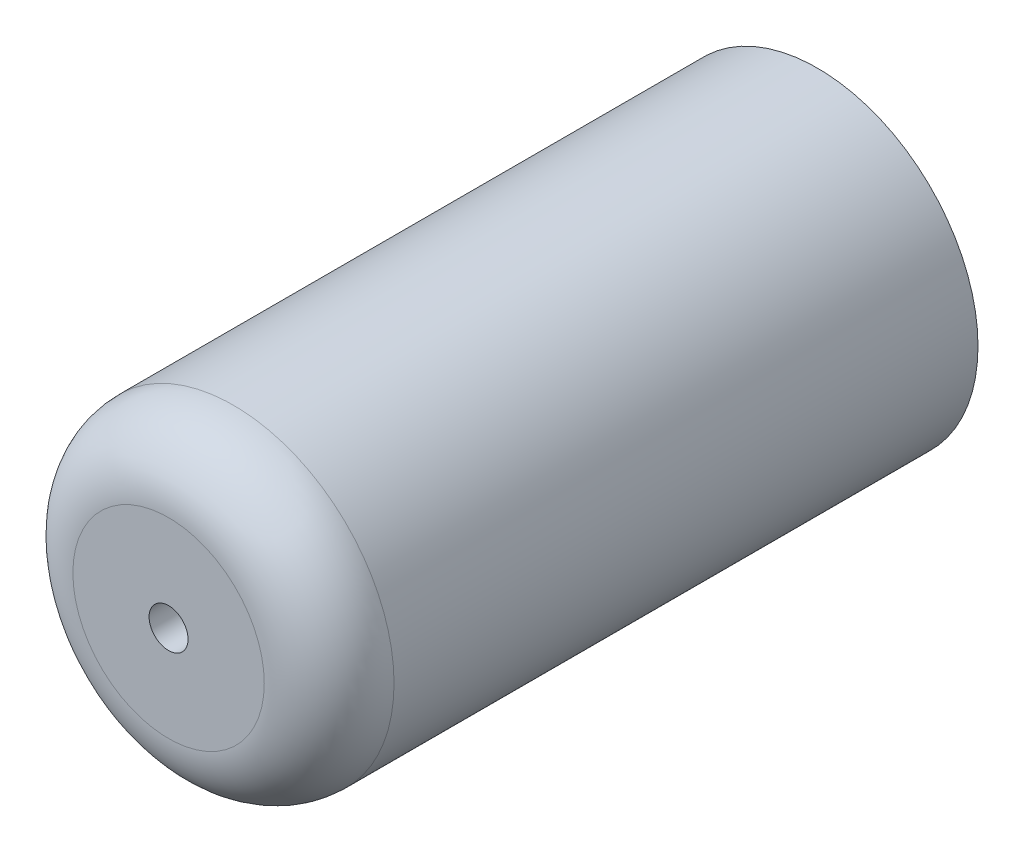
ISO-10303-21;
HEADER;
FILE_DESCRIPTION(('STEP AP214'),'2;1');
FILE_NAME('part.step','',(''),(''),'','','');
FILE_SCHEMA(('AUTOMOTIVE_DESIGN { 1 0 10303 214 1 1 1 1 }'));
ENDSEC;
DATA;
#1=APPLICATION_CONTEXT('core data for automotive mechanical design processes');
#2=APPLICATION_PROTOCOL_DEFINITION('international standard','automotive_design',2000,#1);
#3=PRODUCT_CONTEXT('',#1,'mechanical');
#4=PRODUCT('Part','Part','',(#3));
#5=PRODUCT_RELATED_PRODUCT_CATEGORY('part','',(#4));
#6=PRODUCT_DEFINITION_FORMATION('','',#4);
#7=PRODUCT_DEFINITION_CONTEXT('part definition',#1,'design');
#8=PRODUCT_DEFINITION('design','',#6,#7);
#9=PRODUCT_DEFINITION_SHAPE('','',#8);
#10=(LENGTH_UNIT() NAMED_UNIT(*) SI_UNIT(.MILLI.,.METRE.));
#11=(NAMED_UNIT(*) PLANE_ANGLE_UNIT() SI_UNIT($,.RADIAN.));
#12=(NAMED_UNIT(*) SI_UNIT($,.STERADIAN.) SOLID_ANGLE_UNIT());
#13=UNCERTAINTY_MEASURE_WITH_UNIT(LENGTH_MEASURE(1.E-05),#10,'distance_accuracy_value','');
#14=(GEOMETRIC_REPRESENTATION_CONTEXT(3) GLOBAL_UNCERTAINTY_ASSIGNED_CONTEXT((#13)) GLOBAL_UNIT_ASSIGNED_CONTEXT((#10,
#11,#12)) REPRESENTATION_CONTEXT('',''));
#15=CARTESIAN_POINT('',(0.,0.,0.));
#16=DIRECTION('',(0.,0.,1.));
#17=DIRECTION('',(1.,0.,0.));
#18=AXIS2_PLACEMENT_3D('',#15,#16,#17);
#19=CARTESIAN_POINT('',(0.,0.,50.));
#20=DIRECTION('',(0.,0.,-1.));
#21=DIRECTION('',(-1.,0.,0.));
#22=AXIS2_PLACEMENT_3D('',#19,#20,#21);
#23=CYLINDRICAL_SURFACE('',#22,12.375);
#24=CARTESIAN_POINT('',(0.,0.,45.));
#25=DIRECTION('',(0.,0.,1.));
#26=DIRECTION('',(1.,0.,0.));
#27=AXIS2_PLACEMENT_3D('',#24,#25,#26);
#28=CIRCLE('',#27,12.375);
#29=CARTESIAN_POINT('',(12.375,0.,45.));
#30=VERTEX_POINT('',#29);
#31=EDGE_CURVE('E10',#30,#30,#28,.F.);
#32=ORIENTED_EDGE('',*,*,#31,.T.);
#33=EDGE_LOOP('',(#32));
#34=FACE_BOUND('',#33,.T.);
#35=CARTESIAN_POINT('',(0.,0.,0.));
#36=DIRECTION('',(0.,0.,1.));
#37=DIRECTION('',(1.,0.,0.));
#38=AXIS2_PLACEMENT_3D('',#35,#36,#37);
#39=CIRCLE('',#38,12.375);
#40=CARTESIAN_POINT('',(12.375,0.,0.));
#41=VERTEX_POINT('',#40);
#42=EDGE_CURVE('E45',#41,#41,#39,.T.);
#43=ORIENTED_EDGE('',*,*,#42,.T.);
#44=EDGE_LOOP('',(#43));
#45=FACE_BOUND('',#44,.T.);
#46=ADVANCED_FACE('F34',(#34,#45),#23,.T.);
#47=CARTESIAN_POINT('',(0.,0.,50.));
#48=DIRECTION('',(0.,0.,1.));
#49=DIRECTION('',(1.,0.,0.));
#50=AXIS2_PLACEMENT_3D('',#47,#48,#49);
#51=PLANE('',#50);
#52=CARTESIAN_POINT('',(0.,0.,50.));
#53=DIRECTION('',(0.,0.,-1.));
#54=DIRECTION('',(-1.,0.,0.));
#55=AXIS2_PLACEMENT_3D('',#52,#53,#54);
#56=CIRCLE('',#55,1.5);
#57=CARTESIAN_POINT('',(-1.5,0.,50.));
#58=VERTEX_POINT('',#57);
#59=EDGE_CURVE('E49',#58,#58,#56,.T.);
#60=ORIENTED_EDGE('',*,*,#59,.T.);
#61=EDGE_LOOP('',(#60));
#62=FACE_BOUND('',#61,.T.);
#63=CARTESIAN_POINT('',(0.,0.,50.));
#64=DIRECTION('',(0.,0.,1.));
#65=DIRECTION('',(1.,0.,0.));
#66=AXIS2_PLACEMENT_3D('',#63,#64,#65);
#67=CIRCLE('',#66,7.375);
#68=CARTESIAN_POINT('',(7.375,0.,50.));
#69=VERTEX_POINT('',#68);
#70=EDGE_CURVE('E41',#69,#69,#67,.T.);
#71=ORIENTED_EDGE('',*,*,#70,.T.);
#72=EDGE_LOOP('',(#71));
#73=FACE_BOUND('',#72,.T.);
#74=ADVANCED_FACE('F58',(#62,#73),#51,.T.);
#75=CARTESIAN_POINT('',(0.,0.,0.));
#76=DIRECTION('',(0.,0.,1.));
#77=DIRECTION('',(1.,0.,0.));
#78=AXIS2_PLACEMENT_3D('',#75,#76,#77);
#79=PLANE('',#78);
#80=CARTESIAN_POINT('',(0.,0.,0.));
#81=DIRECTION('',(0.,0.,-1.));
#82=DIRECTION('',(-1.,0.,0.));
#83=AXIS2_PLACEMENT_3D('',#80,#81,#82);
#84=CIRCLE('',#83,1.5);
#85=CARTESIAN_POINT('',(-1.5,0.,0.));
#86=VERTEX_POINT('',#85);
#87=EDGE_CURVE('E52',#86,#86,#84,.T.);
#88=ORIENTED_EDGE('',*,*,#87,.F.);
#89=EDGE_LOOP('',(#88));
#90=FACE_BOUND('',#89,.T.);
#91=ORIENTED_EDGE('',*,*,#42,.F.);
#92=EDGE_LOOP('',(#91));
#93=FACE_BOUND('',#92,.T.);
#94=ADVANCED_FACE('F66',(#90,#93),#79,.F.);
#95=CARTESIAN_POINT('',(0.,0.,45.));
#96=DIRECTION('',(0.,0.,1.));
#97=DIRECTION('',(1.,0.,0.));
#98=AXIS2_PLACEMENT_3D('',#95,#96,#97);
#99=TOROIDAL_SURFACE('',#98,7.375,5.);
#100=ORIENTED_EDGE('',*,*,#31,.F.);
#101=EDGE_LOOP('',(#100));
#102=FACE_BOUND('',#101,.T.);
#103=ORIENTED_EDGE('',*,*,#70,.F.);
#104=EDGE_LOOP('',(#103));
#105=FACE_BOUND('',#104,.T.);
#106=ADVANCED_FACE('F36',(#102,#105),#99,.T.);
#107=CARTESIAN_POINT('',(0.,0.,50.));
#108=DIRECTION('',(0.,0.,-1.));
#109=DIRECTION('',(-1.,0.,0.));
#110=AXIS2_PLACEMENT_3D('',#107,#108,#109);
#111=CYLINDRICAL_SURFACE('',#110,1.5);
#112=ORIENTED_EDGE('',*,*,#59,.F.);
#113=EDGE_LOOP('',(#112));
#114=FACE_BOUND('',#113,.T.);
#115=ORIENTED_EDGE('',*,*,#87,.T.);
#116=EDGE_LOOP('',(#115));
#117=FACE_BOUND('',#116,.T.);
#118=ADVANCED_FACE('F60',(#114,#117),#111,.F.);
#119=CLOSED_SHELL('',(#46,#74,#94,#106,#118));
#120=MANIFOLD_SOLID_BREP('B2',#119);
#121=ADVANCED_BREP_SHAPE_REPRESENTATION('',(#18,#120),#14);
#122=SHAPE_DEFINITION_REPRESENTATION(#9,#121);
ENDSEC;
END-ISO-10303-21;
